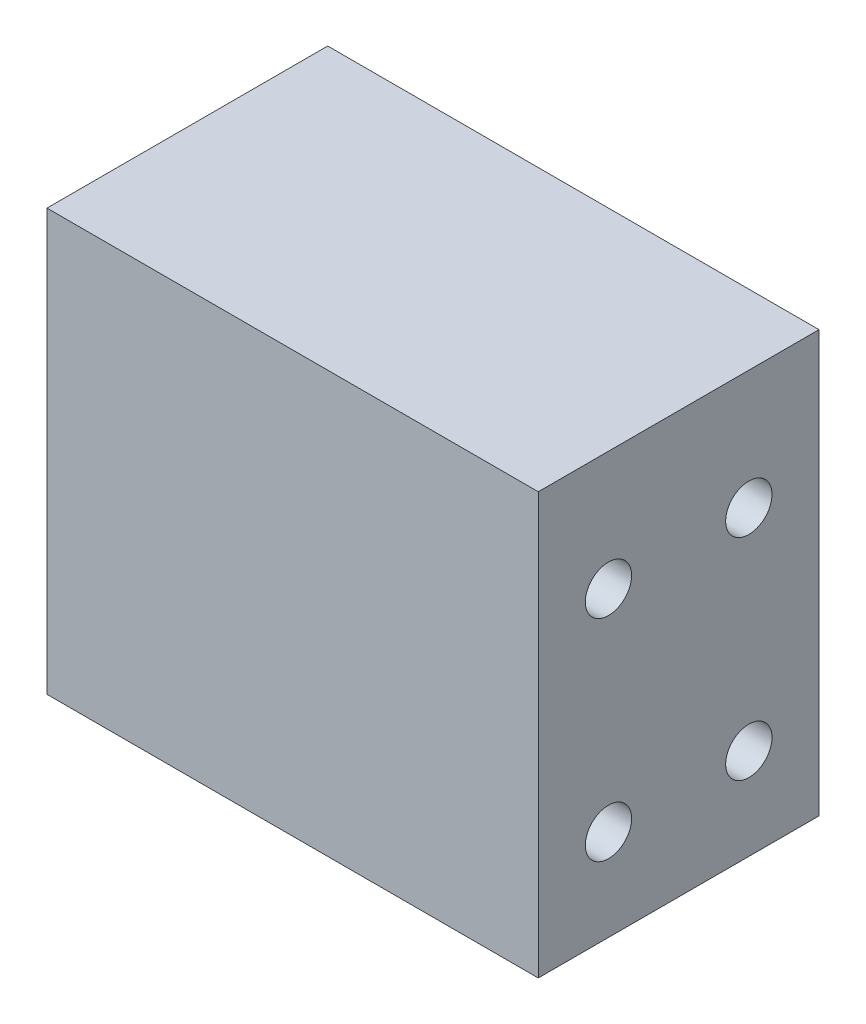
ISO-10303-21;
HEADER;
FILE_DESCRIPTION(('STEP AP214'),'2;1');
FILE_NAME('part.step','',(''),(''),'','','');
FILE_SCHEMA(('AUTOMOTIVE_DESIGN { 1 0 10303 214 1 1 1 1 }'));
ENDSEC;
DATA;
#1=APPLICATION_CONTEXT('core data for automotive mechanical design processes');
#2=APPLICATION_PROTOCOL_DEFINITION('international standard','automotive_design',2000,#1);
#3=PRODUCT_CONTEXT('',#1,'mechanical');
#4=PRODUCT('Part','Part','',(#3));
#5=PRODUCT_RELATED_PRODUCT_CATEGORY('part','',(#4));
#6=PRODUCT_DEFINITION_FORMATION('','',#4);
#7=PRODUCT_DEFINITION_CONTEXT('part definition',#1,'design');
#8=PRODUCT_DEFINITION('design','',#6,#7);
#9=PRODUCT_DEFINITION_SHAPE('','',#8);
#10=(LENGTH_UNIT() NAMED_UNIT(*) SI_UNIT(.MILLI.,.METRE.));
#11=(NAMED_UNIT(*) PLANE_ANGLE_UNIT() SI_UNIT($,.RADIAN.));
#12=(NAMED_UNIT(*) SI_UNIT($,.STERADIAN.) SOLID_ANGLE_UNIT());
#13=UNCERTAINTY_MEASURE_WITH_UNIT(LENGTH_MEASURE(1.E-05),#10,'distance_accuracy_value','');
#14=(GEOMETRIC_REPRESENTATION_CONTEXT(3) GLOBAL_UNCERTAINTY_ASSIGNED_CONTEXT((#13)) GLOBAL_UNIT_ASSIGNED_CONTEXT((#10,
#11,#12)) REPRESENTATION_CONTEXT('',''));
#15=CARTESIAN_POINT('',(0.,0.,0.));
#16=DIRECTION('',(0.,0.,1.));
#17=DIRECTION('',(1.,0.,0.));
#18=AXIS2_PLACEMENT_3D('',#15,#16,#17);
#19=CARTESIAN_POINT('',(0.,0.,20.));
#20=DIRECTION('',(-1.,0.,0.));
#21=DIRECTION('',(0.,-1.,0.));
#22=AXIS2_PLACEMENT_3D('',#19,#20,#21);
#23=PLANE('',#22);
#24=CARTESIAN_POINT('',(0.,21.5125,5.));
#25=DIRECTION('',(1.,0.,0.));
#26=DIRECTION('',(0.,0.,-1.));
#27=AXIS2_PLACEMENT_3D('',#24,#25,#26);
#28=CIRCLE('',#27,1.64999999999999);
#29=CARTESIAN_POINT('',(0.,21.5125,3.35000000000001));
#30=VERTEX_POINT('',#29);
#31=EDGE_CURVE('E124',#30,#30,#28,.T.);
#32=ORIENTED_EDGE('',*,*,#31,.F.);
#33=EDGE_LOOP('',(#32));
#34=FACE_BOUND('',#33,.T.);
#35=CARTESIAN_POINT('',(0.,6.5125,15.));
#36=DIRECTION('',(1.,0.,0.));
#37=DIRECTION('',(0.,0.,-1.));
#38=AXIS2_PLACEMENT_3D('',#35,#36,#37);
#39=CIRCLE('',#38,1.64999999999999);
#40=CARTESIAN_POINT('',(0.,6.5125,13.35));
#41=VERTEX_POINT('',#40);
#42=EDGE_CURVE('E123',#41,#41,#39,.T.);
#43=ORIENTED_EDGE('',*,*,#42,.F.);
#44=EDGE_LOOP('',(#43));
#45=FACE_BOUND('',#44,.T.);
#46=CARTESIAN_POINT('',(0.,6.5125,5.));
#47=DIRECTION('',(1.,0.,0.));
#48=DIRECTION('',(0.,0.,-1.));
#49=AXIS2_PLACEMENT_3D('',#46,#47,#48);
#50=CIRCLE('',#49,1.64999999999999);
#51=CARTESIAN_POINT('',(0.,6.5125,3.35000000000001));
#52=VERTEX_POINT('',#51);
#53=EDGE_CURVE('E137',#52,#52,#50,.T.);
#54=ORIENTED_EDGE('',*,*,#53,.F.);
#55=EDGE_LOOP('',(#54));
#56=FACE_BOUND('',#55,.T.);
#57=CARTESIAN_POINT('',(0.,21.5125,15.));
#58=DIRECTION('',(1.,0.,0.));
#59=DIRECTION('',(0.,0.,-1.));
#60=AXIS2_PLACEMENT_3D('',#57,#58,#59);
#61=CIRCLE('',#60,1.64999999999999);
#62=CARTESIAN_POINT('',(0.,21.5125,13.35));
#63=VERTEX_POINT('',#62);
#64=EDGE_CURVE('E145',#63,#63,#61,.T.);
#65=ORIENTED_EDGE('',*,*,#64,.F.);
#66=EDGE_LOOP('',(#65));
#67=FACE_BOUND('',#66,.T.);
#68=DIRECTION('',(0.,1.,0.));
#69=VECTOR('',#68,1.);
#70=CARTESIAN_POINT('',(0.,0.,0.));
#71=LINE('',#70,#69);
#72=CARTESIAN_POINT('',(0.,0.,0.));
#73=VERTEX_POINT('',#72);
#74=CARTESIAN_POINT('',(0.,30.,0.));
#75=VERTEX_POINT('',#74);
#76=EDGE_CURVE('E185',#73,#75,#71,.T.);
#77=ORIENTED_EDGE('',*,*,#76,.T.);
#78=DIRECTION('',(0.,0.,-1.));
#79=VECTOR('',#78,1.);
#80=CARTESIAN_POINT('',(0.,30.,20.));
#81=LINE('',#80,#79);
#82=CARTESIAN_POINT('',(0.,30.,20.));
#83=VERTEX_POINT('',#82);
#84=EDGE_CURVE('E11',#83,#75,#81,.T.);
#85=ORIENTED_EDGE('',*,*,#84,.F.);
#86=DIRECTION('',(0.,1.,0.));
#87=VECTOR('',#86,1.);
#88=CARTESIAN_POINT('',(0.,0.,20.));
#89=LINE('',#88,#87);
#90=CARTESIAN_POINT('',(0.,0.,20.));
#91=VERTEX_POINT('',#90);
#92=EDGE_CURVE('E186',#91,#83,#89,.T.);
#93=ORIENTED_EDGE('',*,*,#92,.F.);
#94=DIRECTION('',(0.,0.,-1.));
#95=VECTOR('',#94,1.);
#96=CARTESIAN_POINT('',(0.,0.,20.));
#97=LINE('',#96,#95);
#98=EDGE_CURVE('E196',#91,#73,#97,.T.);
#99=ORIENTED_EDGE('',*,*,#98,.T.);
#100=EDGE_LOOP('',(#77,#85,#93,#99));
#101=FACE_BOUND('',#100,.T.);
#102=ADVANCED_FACE('F39',(#34,#45,#56,#67,#101),#23,.F.);
#103=CARTESIAN_POINT('',(0.,30.,20.));
#104=DIRECTION('',(0.,-1.,0.));
#105=DIRECTION('',(1.,0.,0.));
#106=AXIS2_PLACEMENT_3D('',#103,#104,#105);
#107=PLANE('',#106);
#108=DIRECTION('',(-1.,0.,0.));
#109=VECTOR('',#108,1.);
#110=CARTESIAN_POINT('',(0.,30.,0.));
#111=LINE('',#110,#109);
#112=CARTESIAN_POINT('',(-35.,30.,0.));
#113=VERTEX_POINT('',#112);
#114=EDGE_CURVE('E200',#75,#113,#111,.T.);
#115=ORIENTED_EDGE('',*,*,#114,.T.);
#116=DIRECTION('',(0.,0.,-1.));
#117=VECTOR('',#116,1.);
#118=CARTESIAN_POINT('',(-35.,30.,20.));
#119=LINE('',#118,#117);
#120=CARTESIAN_POINT('',(-35.,30.,20.));
#121=VERTEX_POINT('',#120);
#122=EDGE_CURVE('E48',#121,#113,#119,.T.);
#123=ORIENTED_EDGE('',*,*,#122,.F.);
#124=DIRECTION('',(-1.,0.,0.));
#125=VECTOR('',#124,1.);
#126=CARTESIAN_POINT('',(0.,30.,20.));
#127=LINE('',#126,#125);
#128=EDGE_CURVE('E87',#83,#121,#127,.T.);
#129=ORIENTED_EDGE('',*,*,#128,.F.);
#130=ORIENTED_EDGE('',*,*,#84,.T.);
#131=EDGE_LOOP('',(#115,#123,#129,#130));
#132=FACE_BOUND('',#131,.T.);
#133=ADVANCED_FACE('F229',(#132),#107,.F.);
#134=CARTESIAN_POINT('',(-35.,0.,20.));
#135=DIRECTION('',(1.,0.,0.));
#136=DIRECTION('',(0.,0.,-1.));
#137=AXIS2_PLACEMENT_3D('',#134,#135,#136);
#138=PLANE('',#137);
#139=CARTESIAN_POINT('',(-35.,21.5125,5.));
#140=DIRECTION('',(-1.,0.,0.));
#141=DIRECTION('',(0.,0.,1.));
#142=AXIS2_PLACEMENT_3D('',#139,#140,#141);
#143=CIRCLE('',#142,1.64999999999999);
#144=CARTESIAN_POINT('',(-35.,21.5125,6.64999999999999));
#145=VERTEX_POINT('',#144);
#146=EDGE_CURVE('E153',#145,#145,#143,.T.);
#147=ORIENTED_EDGE('',*,*,#146,.F.);
#148=EDGE_LOOP('',(#147));
#149=FACE_BOUND('',#148,.T.);
#150=CARTESIAN_POINT('',(-35.,6.5125,15.));
#151=DIRECTION('',(-1.,0.,0.));
#152=DIRECTION('',(0.,0.,1.));
#153=AXIS2_PLACEMENT_3D('',#150,#151,#152);
#154=CIRCLE('',#153,1.64999999999999);
#155=CARTESIAN_POINT('',(-35.,6.5125,16.65));
#156=VERTEX_POINT('',#155);
#157=EDGE_CURVE('E161',#156,#156,#154,.T.);
#158=ORIENTED_EDGE('',*,*,#157,.F.);
#159=EDGE_LOOP('',(#158));
#160=FACE_BOUND('',#159,.T.);
#161=CARTESIAN_POINT('',(-35.,6.5125,5.));
#162=DIRECTION('',(-1.,0.,0.));
#163=DIRECTION('',(0.,0.,1.));
#164=AXIS2_PLACEMENT_3D('',#161,#162,#163);
#165=CIRCLE('',#164,1.64999999999999);
#166=CARTESIAN_POINT('',(-35.,6.5125,6.64999999999999));
#167=VERTEX_POINT('',#166);
#168=EDGE_CURVE('E169',#167,#167,#165,.T.);
#169=ORIENTED_EDGE('',*,*,#168,.F.);
#170=EDGE_LOOP('',(#169));
#171=FACE_BOUND('',#170,.T.);
#172=CARTESIAN_POINT('',(-35.,21.5125,15.));
#173=DIRECTION('',(-1.,0.,0.));
#174=DIRECTION('',(0.,0.,1.));
#175=AXIS2_PLACEMENT_3D('',#172,#173,#174);
#176=CIRCLE('',#175,1.64999999999999);
#177=CARTESIAN_POINT('',(-35.,21.5125,16.65));
#178=VERTEX_POINT('',#177);
#179=EDGE_CURVE('E177',#178,#178,#176,.T.);
#180=ORIENTED_EDGE('',*,*,#179,.F.);
#181=EDGE_LOOP('',(#180));
#182=FACE_BOUND('',#181,.T.);
#183=DIRECTION('',(0.,-1.,0.));
#184=VECTOR('',#183,1.);
#185=CARTESIAN_POINT('',(-35.,0.,0.));
#186=LINE('',#185,#184);
#187=CARTESIAN_POINT('',(-35.,0.,0.));
#188=VERTEX_POINT('',#187);
#189=EDGE_CURVE('E74',#113,#188,#186,.T.);
#190=ORIENTED_EDGE('',*,*,#189,.T.);
#191=DIRECTION('',(0.,0.,-1.));
#192=VECTOR('',#191,1.);
#193=CARTESIAN_POINT('',(-35.,0.,20.));
#194=LINE('',#193,#192);
#195=CARTESIAN_POINT('',(-35.,0.,20.));
#196=VERTEX_POINT('',#195);
#197=EDGE_CURVE('E209',#196,#188,#194,.T.);
#198=ORIENTED_EDGE('',*,*,#197,.F.);
#199=DIRECTION('',(0.,-1.,0.));
#200=VECTOR('',#199,1.);
#201=CARTESIAN_POINT('',(-35.,0.,20.));
#202=LINE('',#201,#200);
#203=EDGE_CURVE('E191',#121,#196,#202,.T.);
#204=ORIENTED_EDGE('',*,*,#203,.F.);
#205=ORIENTED_EDGE('',*,*,#122,.T.);
#206=EDGE_LOOP('',(#190,#198,#204,#205));
#207=FACE_BOUND('',#206,.T.);
#208=ADVANCED_FACE('F213',(#149,#160,#171,#182,#207),#138,.F.);
#209=CARTESIAN_POINT('',(0.,0.,20.));
#210=DIRECTION('',(0.,1.,0.));
#211=DIRECTION('',(0.,0.,1.));
#212=AXIS2_PLACEMENT_3D('',#209,#210,#211);
#213=PLANE('',#212);
#214=DIRECTION('',(1.,0.,0.));
#215=VECTOR('',#214,1.);
#216=CARTESIAN_POINT('',(0.,0.,0.));
#217=LINE('',#216,#215);
#218=EDGE_CURVE('E80',#188,#73,#217,.T.);
#219=ORIENTED_EDGE('',*,*,#218,.T.);
#220=ORIENTED_EDGE('',*,*,#98,.F.);
#221=DIRECTION('',(1.,0.,0.));
#222=VECTOR('',#221,1.);
#223=CARTESIAN_POINT('',(0.,0.,20.));
#224=LINE('',#223,#222);
#225=EDGE_CURVE('E56',#196,#91,#224,.T.);
#226=ORIENTED_EDGE('',*,*,#225,.F.);
#227=ORIENTED_EDGE('',*,*,#197,.T.);
#228=EDGE_LOOP('',(#219,#220,#226,#227));
#229=FACE_BOUND('',#228,.T.);
#230=ADVANCED_FACE('F220',(#229),#213,.F.);
#231=CARTESIAN_POINT('',(0.,0.,20.));
#232=DIRECTION('',(0.,0.,1.));
#233=DIRECTION('',(1.,0.,0.));
#234=AXIS2_PLACEMENT_3D('',#231,#232,#233);
#235=PLANE('',#234);
#236=ORIENTED_EDGE('',*,*,#92,.T.);
#237=ORIENTED_EDGE('',*,*,#128,.T.);
#238=ORIENTED_EDGE('',*,*,#203,.T.);
#239=ORIENTED_EDGE('',*,*,#225,.T.);
#240=EDGE_LOOP('',(#236,#237,#238,#239));
#241=FACE_BOUND('',#240,.T.);
#242=ADVANCED_FACE('F222',(#241),#235,.T.);
#243=CARTESIAN_POINT('',(0.,0.,0.));
#244=DIRECTION('',(0.,0.,1.));
#245=DIRECTION('',(1.,0.,0.));
#246=AXIS2_PLACEMENT_3D('',#243,#244,#245);
#247=PLANE('',#246);
#248=ORIENTED_EDGE('',*,*,#76,.F.);
#249=ORIENTED_EDGE('',*,*,#218,.F.);
#250=ORIENTED_EDGE('',*,*,#189,.F.);
#251=ORIENTED_EDGE('',*,*,#114,.F.);
#252=EDGE_LOOP('',(#248,#249,#250,#251));
#253=FACE_BOUND('',#252,.T.);
#254=ADVANCED_FACE('F216',(#253),#247,.F.);
#255=CARTESIAN_POINT('',(-21.5,21.5125,15.));
#256=DIRECTION('',(-1.,0.,0.));
#257=DIRECTION('',(0.,0.,1.));
#258=AXIS2_PLACEMENT_3D('',#255,#256,#257);
#259=CONICAL_SURFACE('',#258,1.65,1.02974425867665);
#260=CARTESIAN_POINT('',(-20.5085799786045,21.5125,15.));
#261=VERTEX_POINT('',#260);
#262=VERTEX_LOOP('',#261);
#263=FACE_BOUND('',#262,.T.);
#264=CARTESIAN_POINT('',(-21.5,21.5125,15.));
#265=DIRECTION('',(-1.,0.,0.));
#266=DIRECTION('',(0.,0.,1.));
#267=AXIS2_PLACEMENT_3D('',#264,#265,#266);
#268=CIRCLE('',#267,1.65);
#269=CARTESIAN_POINT('',(-21.5,21.5125,16.65));
#270=VERTEX_POINT('',#269);
#271=EDGE_CURVE('E181',#270,#270,#268,.T.);
#272=ORIENTED_EDGE('',*,*,#271,.T.);
#273=EDGE_LOOP('',(#272));
#274=FACE_BOUND('',#273,.T.);
#275=ADVANCED_FACE('F291',(#263,#274),#259,.F.);
#276=CARTESIAN_POINT('',(-35.,21.5125,15.));
#277=DIRECTION('',(-1.,0.,0.));
#278=DIRECTION('',(0.,0.,1.));
#279=AXIS2_PLACEMENT_3D('',#276,#277,#278);
#280=CYLINDRICAL_SURFACE('',#279,1.65);
#281=ORIENTED_EDGE('',*,*,#271,.F.);
#282=EDGE_LOOP('',(#281));
#283=FACE_BOUND('',#282,.T.);
#284=ORIENTED_EDGE('',*,*,#179,.T.);
#285=EDGE_LOOP('',(#284));
#286=FACE_BOUND('',#285,.T.);
#287=ADVANCED_FACE('F287',(#283,#286),#280,.F.);
#288=CARTESIAN_POINT('',(-21.5,6.5125,5.));
#289=DIRECTION('',(-1.,0.,0.));
#290=DIRECTION('',(0.,0.,1.));
#291=AXIS2_PLACEMENT_3D('',#288,#289,#290);
#292=CONICAL_SURFACE('',#291,1.65,1.02974425867665);
#293=CARTESIAN_POINT('',(-20.5085799786045,6.5125,5.));
#294=VERTEX_POINT('',#293);
#295=VERTEX_LOOP('',#294);
#296=FACE_BOUND('',#295,.T.);
#297=CARTESIAN_POINT('',(-21.5,6.5125,5.));
#298=DIRECTION('',(-1.,0.,0.));
#299=DIRECTION('',(0.,0.,1.));
#300=AXIS2_PLACEMENT_3D('',#297,#298,#299);
#301=CIRCLE('',#300,1.65);
#302=CARTESIAN_POINT('',(-21.5,6.5125,6.65));
#303=VERTEX_POINT('',#302);
#304=EDGE_CURVE('E173',#303,#303,#301,.T.);
#305=ORIENTED_EDGE('',*,*,#304,.T.);
#306=EDGE_LOOP('',(#305));
#307=FACE_BOUND('',#306,.T.);
#308=ADVANCED_FACE('F283',(#296,#307),#292,.F.);
#309=CARTESIAN_POINT('',(-35.,6.5125,5.));
#310=DIRECTION('',(-1.,0.,0.));
#311=DIRECTION('',(0.,0.,1.));
#312=AXIS2_PLACEMENT_3D('',#309,#310,#311);
#313=CYLINDRICAL_SURFACE('',#312,1.64999999999999);
#314=ORIENTED_EDGE('',*,*,#304,.F.);
#315=EDGE_LOOP('',(#314));
#316=FACE_BOUND('',#315,.T.);
#317=ORIENTED_EDGE('',*,*,#168,.T.);
#318=EDGE_LOOP('',(#317));
#319=FACE_BOUND('',#318,.T.);
#320=ADVANCED_FACE('F279',(#316,#319),#313,.F.);
#321=CARTESIAN_POINT('',(-21.5,6.5125,15.));
#322=DIRECTION('',(-1.,0.,0.));
#323=DIRECTION('',(0.,0.,1.));
#324=AXIS2_PLACEMENT_3D('',#321,#322,#323);
#325=CONICAL_SURFACE('',#324,1.65,1.02974425867665);
#326=CARTESIAN_POINT('',(-20.5085799786045,6.5125,15.));
#327=VERTEX_POINT('',#326);
#328=VERTEX_LOOP('',#327);
#329=FACE_BOUND('',#328,.T.);
#330=CARTESIAN_POINT('',(-21.5,6.5125,15.));
#331=DIRECTION('',(-1.,0.,0.));
#332=DIRECTION('',(0.,0.,1.));
#333=AXIS2_PLACEMENT_3D('',#330,#331,#332);
#334=CIRCLE('',#333,1.65);
#335=CARTESIAN_POINT('',(-21.5,6.5125,16.65));
#336=VERTEX_POINT('',#335);
#337=EDGE_CURVE('E165',#336,#336,#334,.T.);
#338=ORIENTED_EDGE('',*,*,#337,.T.);
#339=EDGE_LOOP('',(#338));
#340=FACE_BOUND('',#339,.T.);
#341=ADVANCED_FACE('F275',(#329,#340),#325,.F.);
#342=CARTESIAN_POINT('',(-35.,6.5125,15.));
#343=DIRECTION('',(-1.,0.,0.));
#344=DIRECTION('',(0.,0.,1.));
#345=AXIS2_PLACEMENT_3D('',#342,#343,#344);
#346=CYLINDRICAL_SURFACE('',#345,1.64999999999999);
#347=ORIENTED_EDGE('',*,*,#337,.F.);
#348=EDGE_LOOP('',(#347));
#349=FACE_BOUND('',#348,.T.);
#350=ORIENTED_EDGE('',*,*,#157,.T.);
#351=EDGE_LOOP('',(#350));
#352=FACE_BOUND('',#351,.T.);
#353=ADVANCED_FACE('F271',(#349,#352),#346,.F.);
#354=CARTESIAN_POINT('',(-21.5,21.5125,5.));
#355=DIRECTION('',(-1.,0.,0.));
#356=DIRECTION('',(0.,0.,1.));
#357=AXIS2_PLACEMENT_3D('',#354,#355,#356);
#358=CONICAL_SURFACE('',#357,1.65,1.02974425867665);
#359=CARTESIAN_POINT('',(-20.5085799786045,21.5125,5.));
#360=VERTEX_POINT('',#359);
#361=VERTEX_LOOP('',#360);
#362=FACE_BOUND('',#361,.T.);
#363=CARTESIAN_POINT('',(-21.5,21.5125,5.));
#364=DIRECTION('',(-1.,0.,0.));
#365=DIRECTION('',(0.,0.,1.));
#366=AXIS2_PLACEMENT_3D('',#363,#364,#365);
#367=CIRCLE('',#366,1.65);
#368=CARTESIAN_POINT('',(-21.5,21.5125,6.65));
#369=VERTEX_POINT('',#368);
#370=EDGE_CURVE('E157',#369,#369,#367,.T.);
#371=ORIENTED_EDGE('',*,*,#370,.T.);
#372=EDGE_LOOP('',(#371));
#373=FACE_BOUND('',#372,.T.);
#374=ADVANCED_FACE('F267',(#362,#373),#358,.F.);
#375=CARTESIAN_POINT('',(-35.,21.5125,5.));
#376=DIRECTION('',(-1.,0.,0.));
#377=DIRECTION('',(0.,0.,1.));
#378=AXIS2_PLACEMENT_3D('',#375,#376,#377);
#379=CYLINDRICAL_SURFACE('',#378,1.65);
#380=ORIENTED_EDGE('',*,*,#370,.F.);
#381=EDGE_LOOP('',(#380));
#382=FACE_BOUND('',#381,.T.);
#383=ORIENTED_EDGE('',*,*,#146,.T.);
#384=EDGE_LOOP('',(#383));
#385=FACE_BOUND('',#384,.T.);
#386=ADVANCED_FACE('F259',(#382,#385),#379,.F.);
#387=CARTESIAN_POINT('',(-13.5,21.5125,15.));
#388=DIRECTION('',(1.,0.,0.));
#389=DIRECTION('',(0.,0.,-1.));
#390=AXIS2_PLACEMENT_3D('',#387,#388,#389);
#391=CONICAL_SURFACE('',#390,1.65,1.02974425867665);
#392=CARTESIAN_POINT('',(-14.4914200213955,21.5125,15.));
#393=VERTEX_POINT('',#392);
#394=VERTEX_LOOP('',#393);
#395=FACE_BOUND('',#394,.T.);
#396=CARTESIAN_POINT('',(-13.5,21.5125,15.));
#397=DIRECTION('',(1.,0.,0.));
#398=DIRECTION('',(0.,0.,-1.));
#399=AXIS2_PLACEMENT_3D('',#396,#397,#398);
#400=CIRCLE('',#399,1.65);
#401=CARTESIAN_POINT('',(-13.5,21.5125,13.35));
#402=VERTEX_POINT('',#401);
#403=EDGE_CURVE('E149',#402,#402,#400,.T.);
#404=ORIENTED_EDGE('',*,*,#403,.T.);
#405=EDGE_LOOP('',(#404));
#406=FACE_BOUND('',#405,.T.);
#407=ADVANCED_FACE('F249',(#395,#406),#391,.F.);
#408=CARTESIAN_POINT('',(0.,21.5125,15.));
#409=DIRECTION('',(1.,0.,0.));
#410=DIRECTION('',(0.,0.,-1.));
#411=AXIS2_PLACEMENT_3D('',#408,#409,#410);
#412=CYLINDRICAL_SURFACE('',#411,1.65);
#413=ORIENTED_EDGE('',*,*,#403,.F.);
#414=EDGE_LOOP('',(#413));
#415=FACE_BOUND('',#414,.T.);
#416=ORIENTED_EDGE('',*,*,#64,.T.);
#417=EDGE_LOOP('',(#416));
#418=FACE_BOUND('',#417,.T.);
#419=ADVANCED_FACE('F246',(#415,#418),#412,.F.);
#420=CARTESIAN_POINT('',(-13.5,6.5125,5.));
#421=DIRECTION('',(1.,0.,0.));
#422=DIRECTION('',(0.,0.,-1.));
#423=AXIS2_PLACEMENT_3D('',#420,#421,#422);
#424=CONICAL_SURFACE('',#423,1.65,1.02974425867665);
#425=CARTESIAN_POINT('',(-14.4914200213955,6.5125,5.));
#426=VERTEX_POINT('',#425);
#427=VERTEX_LOOP('',#426);
#428=FACE_BOUND('',#427,.T.);
#429=CARTESIAN_POINT('',(-13.5,6.5125,5.));
#430=DIRECTION('',(1.,0.,0.));
#431=DIRECTION('',(0.,0.,-1.));
#432=AXIS2_PLACEMENT_3D('',#429,#430,#431);
#433=CIRCLE('',#432,1.65);
#434=CARTESIAN_POINT('',(-13.5,6.5125,3.35));
#435=VERTEX_POINT('',#434);
#436=EDGE_CURVE('E141',#435,#435,#433,.T.);
#437=ORIENTED_EDGE('',*,*,#436,.T.);
#438=EDGE_LOOP('',(#437));
#439=FACE_BOUND('',#438,.T.);
#440=ADVANCED_FACE('F248',(#428,#439),#424,.F.);
#441=CARTESIAN_POINT('',(0.,6.5125,5.));
#442=DIRECTION('',(1.,0.,0.));
#443=DIRECTION('',(0.,0.,-1.));
#444=AXIS2_PLACEMENT_3D('',#441,#442,#443);
#445=CYLINDRICAL_SURFACE('',#444,1.64999999999999);
#446=ORIENTED_EDGE('',*,*,#436,.F.);
#447=EDGE_LOOP('',(#446));
#448=FACE_BOUND('',#447,.T.);
#449=ORIENTED_EDGE('',*,*,#53,.T.);
#450=EDGE_LOOP('',(#449));
#451=FACE_BOUND('',#450,.T.);
#452=ADVANCED_FACE('F256',(#448,#451),#445,.F.);
#453=CARTESIAN_POINT('',(-13.5,6.5125,15.));
#454=DIRECTION('',(1.,0.,0.));
#455=DIRECTION('',(0.,0.,-1.));
#456=AXIS2_PLACEMENT_3D('',#453,#454,#455);
#457=CONICAL_SURFACE('',#456,1.65,1.02974425867665);
#458=CARTESIAN_POINT('',(-14.4914200213955,6.5125,15.));
#459=VERTEX_POINT('',#458);
#460=VERTEX_LOOP('',#459);
#461=FACE_BOUND('',#460,.T.);
#462=CARTESIAN_POINT('',(-13.5,6.5125,15.));
#463=DIRECTION('',(1.,0.,0.));
#464=DIRECTION('',(0.,0.,-1.));
#465=AXIS2_PLACEMENT_3D('',#462,#463,#464);
#466=CIRCLE('',#465,1.65);
#467=CARTESIAN_POINT('',(-13.5,6.5125,13.35));
#468=VERTEX_POINT('',#467);
#469=EDGE_CURVE('E129',#468,#468,#466,.T.);
#470=ORIENTED_EDGE('',*,*,#469,.T.);
#471=EDGE_LOOP('',(#470));
#472=FACE_BOUND('',#471,.T.);
#473=ADVANCED_FACE('F358',(#461,#472),#457,.F.);
#474=CARTESIAN_POINT('',(0.,6.5125,15.));
#475=DIRECTION('',(1.,0.,0.));
#476=DIRECTION('',(0.,0.,-1.));
#477=AXIS2_PLACEMENT_3D('',#474,#475,#476);
#478=CYLINDRICAL_SURFACE('',#477,1.64999999999999);
#479=ORIENTED_EDGE('',*,*,#469,.F.);
#480=EDGE_LOOP('',(#479));
#481=FACE_BOUND('',#480,.T.);
#482=ORIENTED_EDGE('',*,*,#42,.T.);
#483=EDGE_LOOP('',(#482));
#484=FACE_BOUND('',#483,.T.);
#485=ADVANCED_FACE('F116',(#481,#484),#478,.F.);
#486=CARTESIAN_POINT('',(-13.5,21.5125,5.));
#487=DIRECTION('',(1.,0.,0.));
#488=DIRECTION('',(0.,0.,-1.));
#489=AXIS2_PLACEMENT_3D('',#486,#487,#488);
#490=CONICAL_SURFACE('',#489,1.65,1.02974425867665);
#491=CARTESIAN_POINT('',(-14.4914200213955,21.5125,5.));
#492=VERTEX_POINT('',#491);
#493=VERTEX_LOOP('',#492);
#494=FACE_BOUND('',#493,.T.);
#495=CARTESIAN_POINT('',(-13.5,21.5125,5.));
#496=DIRECTION('',(1.,0.,0.));
#497=DIRECTION('',(0.,0.,-1.));
#498=AXIS2_PLACEMENT_3D('',#495,#496,#497);
#499=CIRCLE('',#498,1.65);
#500=CARTESIAN_POINT('',(-13.5,21.5125,3.35));
#501=VERTEX_POINT('',#500);
#502=EDGE_CURVE('E120',#501,#501,#499,.T.);
#503=ORIENTED_EDGE('',*,*,#502,.T.);
#504=EDGE_LOOP('',(#503));
#505=FACE_BOUND('',#504,.T.);
#506=ADVANCED_FACE('F112',(#494,#505),#490,.F.);
#507=CARTESIAN_POINT('',(0.,21.5125,5.));
#508=DIRECTION('',(1.,0.,0.));
#509=DIRECTION('',(0.,0.,-1.));
#510=AXIS2_PLACEMENT_3D('',#507,#508,#509);
#511=CYLINDRICAL_SURFACE('',#510,1.65);
#512=ORIENTED_EDGE('',*,*,#502,.F.);
#513=EDGE_LOOP('',(#512));
#514=FACE_BOUND('',#513,.T.);
#515=ORIENTED_EDGE('',*,*,#31,.T.);
#516=EDGE_LOOP('',(#515));
#517=FACE_BOUND('',#516,.T.);
#518=ADVANCED_FACE('F115',(#514,#517),#511,.F.);
#519=CLOSED_SHELL('',(#102,#133,#208,#230,#242,#254,#275,#287,#308,#320,#341,#353,#374,#386,
#407,#419,#440,#452,#473,#485,#506,#518));
#520=MANIFOLD_SOLID_BREP('B2',#519);
#521=ADVANCED_BREP_SHAPE_REPRESENTATION('',(#18,#520),#14);
#522=SHAPE_DEFINITION_REPRESENTATION(#9,#521);
ENDSEC;
END-ISO-10303-21;
